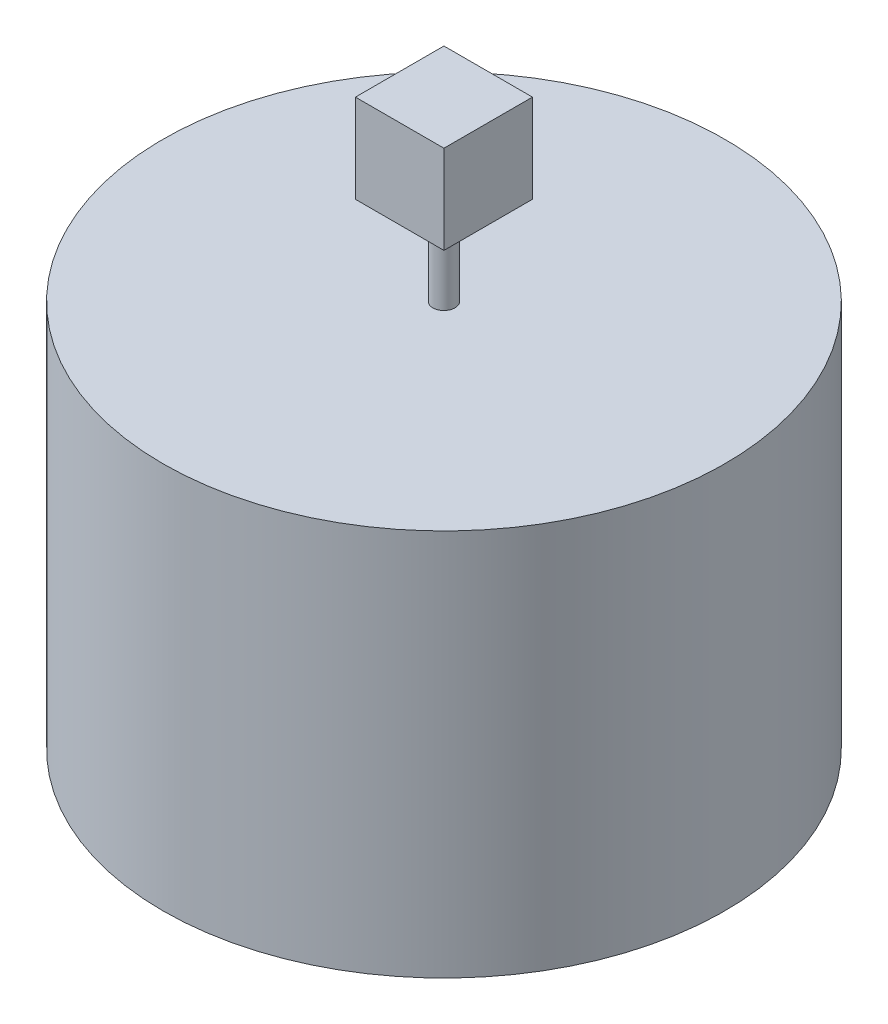
ISO-10303-21;
HEADER;
FILE_DESCRIPTION(('STEP AP214'),'2;1');
FILE_NAME('part.step','',(''),(''),'','','');
FILE_SCHEMA(('AUTOMOTIVE_DESIGN { 1 0 10303 214 1 1 1 1 }'));
ENDSEC;
DATA;
#1=APPLICATION_CONTEXT('core data for automotive mechanical design processes');
#2=APPLICATION_PROTOCOL_DEFINITION('international standard','automotive_design',2000,#1);
#3=PRODUCT_CONTEXT('',#1,'mechanical');
#4=PRODUCT('Part','Part','',(#3));
#5=PRODUCT_RELATED_PRODUCT_CATEGORY('part','',(#4));
#6=PRODUCT_DEFINITION_FORMATION('','',#4);
#7=PRODUCT_DEFINITION_CONTEXT('part definition',#1,'design');
#8=PRODUCT_DEFINITION('design','',#6,#7);
#9=PRODUCT_DEFINITION_SHAPE('','',#8);
#10=(LENGTH_UNIT() NAMED_UNIT(*) SI_UNIT(.MILLI.,.METRE.));
#11=(NAMED_UNIT(*) PLANE_ANGLE_UNIT() SI_UNIT($,.RADIAN.));
#12=(NAMED_UNIT(*) SI_UNIT($,.STERADIAN.) SOLID_ANGLE_UNIT());
#13=UNCERTAINTY_MEASURE_WITH_UNIT(LENGTH_MEASURE(1.E-05),#10,'distance_accuracy_value','');
#14=(GEOMETRIC_REPRESENTATION_CONTEXT(3) GLOBAL_UNCERTAINTY_ASSIGNED_CONTEXT((#13)) GLOBAL_UNIT_ASSIGNED_CONTEXT((#10,
#11,#12)) REPRESENTATION_CONTEXT('',''));
#15=CARTESIAN_POINT('',(0.,0.,0.));
#16=DIRECTION('',(0.,0.,1.));
#17=DIRECTION('',(1.,0.,0.));
#18=AXIS2_PLACEMENT_3D('',#15,#16,#17);
#19=CARTESIAN_POINT('',(0.,350.,0.));
#20=DIRECTION('',(0.,1.,0.));
#21=DIRECTION('',(0.,0.,1.));
#22=AXIS2_PLACEMENT_3D('',#19,#20,#21);
#23=PLANE('',#22);
#24=CARTESIAN_POINT('',(0.,350.,0.));
#25=DIRECTION('',(0.,1.,0.));
#26=DIRECTION('',(0.,0.,1.));
#27=AXIS2_PLACEMENT_3D('',#24,#25,#26);
#28=CIRCLE('',#27,254.);
#29=CARTESIAN_POINT('',(0.,350.,254.));
#30=VERTEX_POINT('',#29);
#31=EDGE_CURVE('E11',#30,#30,#28,.T.);
#32=ORIENTED_EDGE('',*,*,#31,.T.);
#33=EDGE_LOOP('',(#32));
#34=FACE_BOUND('',#33,.T.);
#35=CARTESIAN_POINT('',(0.,350.,0.));
#36=DIRECTION('',(0.,1.,0.));
#37=DIRECTION('',(0.,0.,1.));
#38=AXIS2_PLACEMENT_3D('',#35,#36,#37);
#39=CIRCLE('',#38,10.);
#40=CARTESIAN_POINT('',(0.,350.,10.));
#41=VERTEX_POINT('',#40);
#42=EDGE_CURVE('E108',#41,#41,#39,.T.);
#43=ORIENTED_EDGE('',*,*,#42,.F.);
#44=EDGE_LOOP('',(#43));
#45=FACE_BOUND('',#44,.T.);
#46=ADVANCED_FACE('F31',(#34,#45),#23,.T.);
#47=CARTESIAN_POINT('',(0.,350.,0.));
#48=DIRECTION('',(0.,-1.,0.));
#49=DIRECTION('',(0.,0.,-1.));
#50=AXIS2_PLACEMENT_3D('',#47,#48,#49);
#51=CYLINDRICAL_SURFACE('',#50,254.);
#52=ORIENTED_EDGE('',*,*,#31,.F.);
#53=EDGE_LOOP('',(#52));
#54=FACE_BOUND('',#53,.T.);
#55=CARTESIAN_POINT('',(0.,0.,0.));
#56=DIRECTION('',(0.,1.,0.));
#57=DIRECTION('',(0.,0.,1.));
#58=AXIS2_PLACEMENT_3D('',#55,#56,#57);
#59=CIRCLE('',#58,254.);
#60=CARTESIAN_POINT('',(0.,0.,254.));
#61=VERTEX_POINT('',#60);
#62=EDGE_CURVE('E35',#61,#61,#59,.T.);
#63=ORIENTED_EDGE('',*,*,#62,.T.);
#64=EDGE_LOOP('',(#63));
#65=FACE_BOUND('',#64,.T.);
#66=ADVANCED_FACE('F33',(#54,#65),#51,.T.);
#67=CARTESIAN_POINT('',(0.,0.,0.));
#68=DIRECTION('',(0.,1.,0.));
#69=DIRECTION('',(0.,0.,1.));
#70=AXIS2_PLACEMENT_3D('',#67,#68,#69);
#71=PLANE('',#70);
#72=ORIENTED_EDGE('',*,*,#62,.F.);
#73=EDGE_LOOP('',(#72));
#74=FACE_BOUND('',#73,.T.);
#75=ADVANCED_FACE('F123',(#74),#71,.F.);
#76=CARTESIAN_POINT('',(0.,430.,0.));
#77=DIRECTION('',(0.,-1.,0.));
#78=DIRECTION('',(0.,0.,-1.));
#79=AXIS2_PLACEMENT_3D('',#76,#77,#78);
#80=CYLINDRICAL_SURFACE('',#79,10.);
#81=CARTESIAN_POINT('',(0.,430.,0.));
#82=DIRECTION('',(0.,1.,0.));
#83=DIRECTION('',(0.,0.,1.));
#84=AXIS2_PLACEMENT_3D('',#81,#82,#83);
#85=CIRCLE('',#84,10.);
#86=CARTESIAN_POINT('',(0.,430.,10.));
#87=VERTEX_POINT('',#86);
#88=EDGE_CURVE('E109',#87,#87,#85,.T.);
#89=ORIENTED_EDGE('',*,*,#88,.F.);
#90=EDGE_LOOP('',(#89));
#91=FACE_BOUND('',#90,.T.);
#92=ORIENTED_EDGE('',*,*,#42,.T.);
#93=EDGE_LOOP('',(#92));
#94=FACE_BOUND('',#93,.T.);
#95=ADVANCED_FACE('F115',(#91,#94),#80,.T.);
#96=CARTESIAN_POINT('',(-40.,430.,-40.));
#97=DIRECTION('',(0.,-1.,0.));
#98=DIRECTION('',(0.,0.,-1.));
#99=AXIS2_PLACEMENT_3D('',#96,#97,#98);
#100=PLANE('',#99);
#101=DIRECTION('',(0.,0.,1.));
#102=VECTOR('',#101,1.);
#103=CARTESIAN_POINT('',(-40.,430.,40.));
#104=LINE('',#103,#102);
#105=CARTESIAN_POINT('',(-40.,430.,-40.));
#106=VERTEX_POINT('',#105);
#107=CARTESIAN_POINT('',(-40.,430.,40.));
#108=VERTEX_POINT('',#107);
#109=EDGE_CURVE('E99',#106,#108,#104,.T.);
#110=ORIENTED_EDGE('',*,*,#109,.F.);
#111=DIRECTION('',(-1.,0.,0.));
#112=VECTOR('',#111,1.);
#113=CARTESIAN_POINT('',(-40.,430.,-40.));
#114=LINE('',#113,#112);
#115=CARTESIAN_POINT('',(40.,430.,-40.));
#116=VERTEX_POINT('',#115);
#117=EDGE_CURVE('E71',#116,#106,#114,.T.);
#118=ORIENTED_EDGE('',*,*,#117,.F.);
#119=DIRECTION('',(0.,0.,-1.));
#120=VECTOR('',#119,1.);
#121=CARTESIAN_POINT('',(40.,430.,40.));
#122=LINE('',#121,#120);
#123=CARTESIAN_POINT('',(40.,430.,40.));
#124=VERTEX_POINT('',#123);
#125=EDGE_CURVE('E65',#124,#116,#122,.T.);
#126=ORIENTED_EDGE('',*,*,#125,.F.);
#127=DIRECTION('',(1.,0.,0.));
#128=VECTOR('',#127,1.);
#129=CARTESIAN_POINT('',(-40.,430.,40.));
#130=LINE('',#129,#128);
#131=EDGE_CURVE('E89',#108,#124,#130,.T.);
#132=ORIENTED_EDGE('',*,*,#131,.F.);
#133=EDGE_LOOP('',(#110,#118,#126,#132));
#134=FACE_BOUND('',#133,.T.);
#135=ORIENTED_EDGE('',*,*,#88,.T.);
#136=EDGE_LOOP('',(#135));
#137=FACE_BOUND('',#136,.T.);
#138=ADVANCED_FACE('F132',(#134,#137),#100,.T.);
#139=CARTESIAN_POINT('',(-40.,510.,40.));
#140=DIRECTION('',(1.,0.,0.));
#141=DIRECTION('',(0.,0.,-1.));
#142=AXIS2_PLACEMENT_3D('',#139,#140,#141);
#143=PLANE('',#142);
#144=ORIENTED_EDGE('',*,*,#109,.T.);
#145=DIRECTION('',(0.,-1.,0.));
#146=VECTOR('',#145,1.);
#147=CARTESIAN_POINT('',(-40.,510.,40.));
#148=LINE('',#147,#146);
#149=CARTESIAN_POINT('',(-40.,510.,40.));
#150=VERTEX_POINT('',#149);
#151=EDGE_CURVE('E90',#150,#108,#148,.T.);
#152=ORIENTED_EDGE('',*,*,#151,.F.);
#153=DIRECTION('',(0.,0.,1.));
#154=VECTOR('',#153,1.);
#155=CARTESIAN_POINT('',(-40.,510.,40.));
#156=LINE('',#155,#154);
#157=CARTESIAN_POINT('',(-40.,510.,-40.));
#158=VERTEX_POINT('',#157);
#159=EDGE_CURVE('E84',#158,#150,#156,.T.);
#160=ORIENTED_EDGE('',*,*,#159,.F.);
#161=DIRECTION('',(0.,-1.,0.));
#162=VECTOR('',#161,1.);
#163=CARTESIAN_POINT('',(-40.,510.,-40.));
#164=LINE('',#163,#162);
#165=EDGE_CURVE('E95',#158,#106,#164,.T.);
#166=ORIENTED_EDGE('',*,*,#165,.T.);
#167=EDGE_LOOP('',(#144,#152,#160,#166));
#168=FACE_BOUND('',#167,.T.);
#169=ADVANCED_FACE('F140',(#168),#143,.F.);
#170=CARTESIAN_POINT('',(-40.,510.,40.));
#171=DIRECTION('',(0.,0.,-1.));
#172=DIRECTION('',(-1.,0.,0.));
#173=AXIS2_PLACEMENT_3D('',#170,#171,#172);
#174=PLANE('',#173);
#175=ORIENTED_EDGE('',*,*,#131,.T.);
#176=DIRECTION('',(0.,-1.,0.));
#177=VECTOR('',#176,1.);
#178=CARTESIAN_POINT('',(40.,510.,40.));
#179=LINE('',#178,#177);
#180=CARTESIAN_POINT('',(40.,510.,40.));
#181=VERTEX_POINT('',#180);
#182=EDGE_CURVE('E87',#181,#124,#179,.T.);
#183=ORIENTED_EDGE('',*,*,#182,.F.);
#184=DIRECTION('',(1.,0.,0.));
#185=VECTOR('',#184,1.);
#186=CARTESIAN_POINT('',(-40.,510.,40.));
#187=LINE('',#186,#185);
#188=EDGE_CURVE('E79',#150,#181,#187,.T.);
#189=ORIENTED_EDGE('',*,*,#188,.F.);
#190=ORIENTED_EDGE('',*,*,#151,.T.);
#191=EDGE_LOOP('',(#175,#183,#189,#190));
#192=FACE_BOUND('',#191,.T.);
#193=ADVANCED_FACE('F88',(#192),#174,.F.);
#194=CARTESIAN_POINT('',(40.,510.,40.));
#195=DIRECTION('',(-1.,0.,0.));
#196=DIRECTION('',(0.,0.,1.));
#197=AXIS2_PLACEMENT_3D('',#194,#195,#196);
#198=PLANE('',#197);
#199=ORIENTED_EDGE('',*,*,#125,.T.);
#200=DIRECTION('',(0.,-1.,0.));
#201=VECTOR('',#200,1.);
#202=CARTESIAN_POINT('',(40.,510.,-40.));
#203=LINE('',#202,#201);
#204=CARTESIAN_POINT('',(40.,510.,-40.));
#205=VERTEX_POINT('',#204);
#206=EDGE_CURVE('E91',#205,#116,#203,.T.);
#207=ORIENTED_EDGE('',*,*,#206,.F.);
#208=DIRECTION('',(0.,0.,-1.));
#209=VECTOR('',#208,1.);
#210=CARTESIAN_POINT('',(40.,510.,40.));
#211=LINE('',#210,#209);
#212=EDGE_CURVE('E82',#181,#205,#211,.T.);
#213=ORIENTED_EDGE('',*,*,#212,.F.);
#214=ORIENTED_EDGE('',*,*,#182,.T.);
#215=EDGE_LOOP('',(#199,#207,#213,#214));
#216=FACE_BOUND('',#215,.T.);
#217=ADVANCED_FACE('F93',(#216),#198,.F.);
#218=CARTESIAN_POINT('',(-40.,510.,-40.));
#219=DIRECTION('',(0.,0.,1.));
#220=DIRECTION('',(1.,0.,0.));
#221=AXIS2_PLACEMENT_3D('',#218,#219,#220);
#222=PLANE('',#221);
#223=ORIENTED_EDGE('',*,*,#117,.T.);
#224=ORIENTED_EDGE('',*,*,#165,.F.);
#225=DIRECTION('',(-1.,0.,0.));
#226=VECTOR('',#225,1.);
#227=CARTESIAN_POINT('',(-40.,510.,-40.));
#228=LINE('',#227,#226);
#229=EDGE_CURVE('E48',#205,#158,#228,.T.);
#230=ORIENTED_EDGE('',*,*,#229,.F.);
#231=ORIENTED_EDGE('',*,*,#206,.T.);
#232=EDGE_LOOP('',(#223,#224,#230,#231));
#233=FACE_BOUND('',#232,.T.);
#234=ADVANCED_FACE('F152',(#233),#222,.F.);
#235=CARTESIAN_POINT('',(-40.,510.,-40.));
#236=DIRECTION('',(0.,-1.,0.));
#237=DIRECTION('',(0.,0.,-1.));
#238=AXIS2_PLACEMENT_3D('',#235,#236,#237);
#239=PLANE('',#238);
#240=ORIENTED_EDGE('',*,*,#159,.T.);
#241=ORIENTED_EDGE('',*,*,#188,.T.);
#242=ORIENTED_EDGE('',*,*,#212,.T.);
#243=ORIENTED_EDGE('',*,*,#229,.T.);
#244=EDGE_LOOP('',(#240,#241,#242,#243));
#245=FACE_BOUND('',#244,.T.);
#246=ADVANCED_FACE('F80',(#245),#239,.F.);
#247=CLOSED_SHELL('',(#46,#66,#75,#95,#138,#169,#193,#217,#234,#246));
#248=MANIFOLD_SOLID_BREP('B2',#247);
#249=ADVANCED_BREP_SHAPE_REPRESENTATION('',(#18,#248),#14);
#250=SHAPE_DEFINITION_REPRESENTATION(#9,#249);
ENDSEC;
END-ISO-10303-21;
